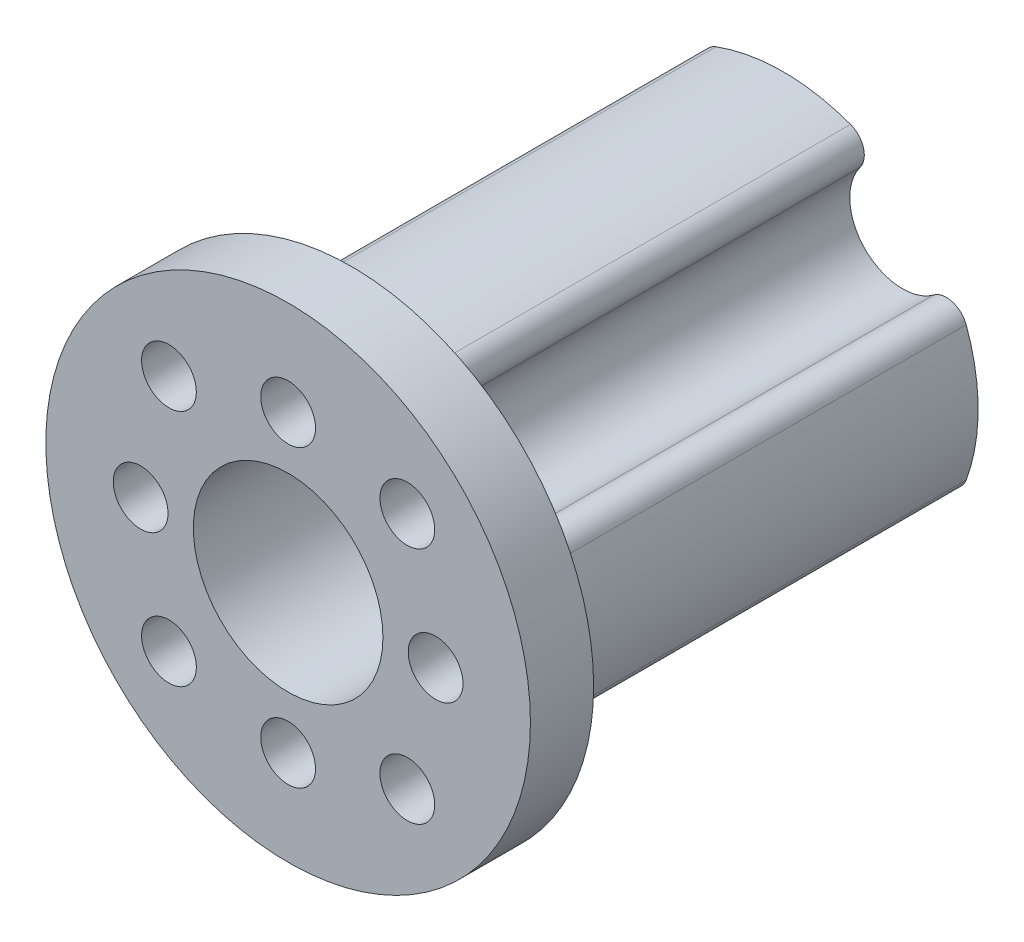
ISO-10303-21;
HEADER;
FILE_DESCRIPTION(('STEP AP214'),'2;1');
FILE_NAME('part.step','',(''),(''),'','','');
FILE_SCHEMA(('AUTOMOTIVE_DESIGN { 1 0 10303 214 1 1 1 1 }'));
ENDSEC;
DATA;
#1=APPLICATION_CONTEXT('core data for automotive mechanical design processes');
#2=APPLICATION_PROTOCOL_DEFINITION('international standard','automotive_design',2000,#1);
#3=PRODUCT_CONTEXT('',#1,'mechanical');
#4=PRODUCT('Part','Part','',(#3));
#5=PRODUCT_RELATED_PRODUCT_CATEGORY('part','',(#4));
#6=PRODUCT_DEFINITION_FORMATION('','',#4);
#7=PRODUCT_DEFINITION_CONTEXT('part definition',#1,'design');
#8=PRODUCT_DEFINITION('design','',#6,#7);
#9=PRODUCT_DEFINITION_SHAPE('','',#8);
#10=(LENGTH_UNIT() NAMED_UNIT(*) SI_UNIT(.MILLI.,.METRE.));
#11=(NAMED_UNIT(*) PLANE_ANGLE_UNIT() SI_UNIT($,.RADIAN.));
#12=(NAMED_UNIT(*) SI_UNIT($,.STERADIAN.) SOLID_ANGLE_UNIT());
#13=UNCERTAINTY_MEASURE_WITH_UNIT(LENGTH_MEASURE(1.E-05),#10,'distance_accuracy_value','');
#14=(GEOMETRIC_REPRESENTATION_CONTEXT(3) GLOBAL_UNCERTAINTY_ASSIGNED_CONTEXT((#13)) GLOBAL_UNIT_ASSIGNED_CONTEXT((#10,
#11,#12)) REPRESENTATION_CONTEXT('',''));
#15=CARTESIAN_POINT('',(0.,0.,0.));
#16=DIRECTION('',(0.,0.,1.));
#17=DIRECTION('',(1.,0.,0.));
#18=AXIS2_PLACEMENT_3D('',#15,#16,#17);
#19=CARTESIAN_POINT('',(-5.65685424949241,-5.65685424949235,0.));
#20=DIRECTION('',(0.,0.,1.));
#21=DIRECTION('',(1.,0.,0.));
#22=AXIS2_PLACEMENT_3D('',#19,#20,#21);
#23=CYLINDRICAL_SURFACE('',#22,2.5);
#24=CARTESIAN_POINT('',(-5.65685424949241,-5.65685424949235,0.));
#25=DIRECTION('',(0.,0.,1.));
#26=DIRECTION('',(1.,0.,0.));
#27=AXIS2_PLACEMENT_3D('',#24,#25,#26);
#28=CIRCLE('',#27,2.5);
#29=CARTESIAN_POINT('',(-3.64962625954334,-7.14716824203386,0.));
#30=VERTEX_POINT('',#29);
#31=CARTESIAN_POINT('',(-7.1471682420339,-3.64962625954327,0.));
#32=VERTEX_POINT('',#31);
#33=EDGE_CURVE('E260',#30,#32,#28,.T.);
#34=ORIENTED_EDGE('',*,*,#33,.F.);
#35=DIRECTION('',(0.,0.,1.));
#36=VECTOR('',#35,1.);
#37=CARTESIAN_POINT('',(-3.64962625954334,-7.14716824203386,0.));
#38=LINE('',#37,#36);
#39=CARTESIAN_POINT('',(-3.64962625954334,-7.14716824203386,20.5));
#40=VERTEX_POINT('',#39);
#41=EDGE_CURVE('E203',#30,#40,#38,.T.);
#42=ORIENTED_EDGE('',*,*,#41,.T.);
#43=CARTESIAN_POINT('',(-5.65685424949241,-5.65685424949235,20.5));
#44=DIRECTION('',(0.,0.,1.));
#45=DIRECTION('',(1.,0.,0.));
#46=AXIS2_PLACEMENT_3D('',#43,#44,#45);
#47=CIRCLE('',#46,2.5);
#48=CARTESIAN_POINT('',(-7.1471682420339,-3.64962625954327,20.5));
#49=VERTEX_POINT('',#48);
#50=EDGE_CURVE('E175',#49,#40,#47,.F.);
#51=ORIENTED_EDGE('',*,*,#50,.F.);
#52=DIRECTION('',(0.,0.,1.));
#53=VECTOR('',#52,1.);
#54=CARTESIAN_POINT('',(-7.1471682420339,-3.64962625954327,0.));
#55=LINE('',#54,#53);
#56=EDGE_CURVE('E201',#49,#32,#55,.F.);
#57=ORIENTED_EDGE('',*,*,#56,.T.);
#58=EDGE_LOOP('',(#34,#42,#51,#57));
#59=FACE_BOUND('',#58,.T.);
#60=ADVANCED_FACE('F32',(#59),#23,.F.);
#61=CARTESIAN_POINT('',(5.65685424949235,-5.65685424949241,0.));
#62=DIRECTION('',(0.,0.,1.));
#63=DIRECTION('',(1.,0.,0.));
#64=AXIS2_PLACEMENT_3D('',#61,#62,#63);
#65=CYLINDRICAL_SURFACE('',#64,2.49999999999996);
#66=CARTESIAN_POINT('',(5.65685424949235,-5.65685424949241,0.));
#67=DIRECTION('',(0.,0.,1.));
#68=DIRECTION('',(1.,0.,0.));
#69=AXIS2_PLACEMENT_3D('',#66,#67,#68);
#70=CIRCLE('',#69,2.49999999999996);
#71=CARTESIAN_POINT('',(7.14716824203385,-3.64962625954338,0.));
#72=VERTEX_POINT('',#71);
#73=CARTESIAN_POINT('',(3.6496262595433,-7.14716824203389,0.));
#74=VERTEX_POINT('',#73);
#75=EDGE_CURVE('E254',#72,#74,#70,.T.);
#76=ORIENTED_EDGE('',*,*,#75,.F.);
#77=DIRECTION('',(0.,0.,1.));
#78=VECTOR('',#77,1.);
#79=CARTESIAN_POINT('',(7.14716824203385,-3.64962625954338,0.));
#80=LINE('',#79,#78);
#81=CARTESIAN_POINT('',(7.14716824203387,-3.64962625954334,20.5));
#82=VERTEX_POINT('',#81);
#83=EDGE_CURVE('E193',#72,#82,#80,.T.);
#84=ORIENTED_EDGE('',*,*,#83,.T.);
#85=CARTESIAN_POINT('',(5.65685424949235,-5.65685424949241,20.5));
#86=DIRECTION('',(0.,0.,1.));
#87=DIRECTION('',(1.,0.,0.));
#88=AXIS2_PLACEMENT_3D('',#85,#86,#87);
#89=CIRCLE('',#88,2.5);
#90=CARTESIAN_POINT('',(3.64962625954327,-7.14716824203391,20.5));
#91=VERTEX_POINT('',#90);
#92=EDGE_CURVE('E150',#82,#91,#89,.T.);
#93=ORIENTED_EDGE('',*,*,#92,.T.);
#94=DIRECTION('',(0.,0.,1.));
#95=VECTOR('',#94,1.);
#96=CARTESIAN_POINT('',(3.6496262595433,-7.14716824203389,0.));
#97=LINE('',#96,#95);
#98=EDGE_CURVE('E191',#91,#74,#97,.F.);
#99=ORIENTED_EDGE('',*,*,#98,.T.);
#100=EDGE_LOOP('',(#76,#84,#93,#99));
#101=FACE_BOUND('',#100,.T.);
#102=ADVANCED_FACE('F330',(#101),#65,.F.);
#103=CARTESIAN_POINT('',(5.65685424949241,5.65685424949235,0.));
#104=DIRECTION('',(0.,0.,1.));
#105=DIRECTION('',(1.,0.,0.));
#106=AXIS2_PLACEMENT_3D('',#103,#104,#105);
#107=CYLINDRICAL_SURFACE('',#106,2.5);
#108=CARTESIAN_POINT('',(5.65685424949241,5.65685424949235,0.));
#109=DIRECTION('',(0.,0.,1.));
#110=DIRECTION('',(1.,0.,0.));
#111=AXIS2_PLACEMENT_3D('',#108,#109,#110);
#112=CIRCLE('',#111,2.5);
#113=CARTESIAN_POINT('',(3.64962625954334,7.14716824203386,0.));
#114=VERTEX_POINT('',#113);
#115=CARTESIAN_POINT('',(7.1471682420339,3.64962625954327,0.));
#116=VERTEX_POINT('',#115);
#117=EDGE_CURVE('E249',#114,#116,#112,.T.);
#118=ORIENTED_EDGE('',*,*,#117,.F.);
#119=DIRECTION('',(0.,0.,1.));
#120=VECTOR('',#119,1.);
#121=CARTESIAN_POINT('',(3.64962625954334,7.14716824203386,0.));
#122=LINE('',#121,#120);
#123=CARTESIAN_POINT('',(3.64962625954334,7.14716824203387,20.5));
#124=VERTEX_POINT('',#123);
#125=EDGE_CURVE('E52',#114,#124,#122,.T.);
#126=ORIENTED_EDGE('',*,*,#125,.T.);
#127=CARTESIAN_POINT('',(5.65685424949241,5.65685424949235,20.5));
#128=DIRECTION('',(0.,0.,1.));
#129=DIRECTION('',(1.,0.,0.));
#130=AXIS2_PLACEMENT_3D('',#127,#128,#129);
#131=CIRCLE('',#130,2.5);
#132=CARTESIAN_POINT('',(7.1471682420339,3.64962625954327,20.5));
#133=VERTEX_POINT('',#132);
#134=EDGE_CURVE('E235',#124,#133,#131,.T.);
#135=ORIENTED_EDGE('',*,*,#134,.T.);
#136=DIRECTION('',(0.,0.,1.));
#137=VECTOR('',#136,1.);
#138=CARTESIAN_POINT('',(7.1471682420339,3.64962625954327,0.));
#139=LINE('',#138,#137);
#140=EDGE_CURVE('E221',#133,#116,#139,.F.);
#141=ORIENTED_EDGE('',*,*,#140,.T.);
#142=EDGE_LOOP('',(#118,#126,#135,#141));
#143=FACE_BOUND('',#142,.T.);
#144=ADVANCED_FACE('F251',(#143),#107,.F.);
#145=CARTESIAN_POINT('',(-5.65685424949235,5.65685424949241,0.));
#146=DIRECTION('',(0.,0.,1.));
#147=DIRECTION('',(1.,0.,0.));
#148=AXIS2_PLACEMENT_3D('',#145,#146,#147);
#149=CYLINDRICAL_SURFACE('',#148,2.5);
#150=CARTESIAN_POINT('',(-5.65685424949235,5.65685424949241,0.));
#151=DIRECTION('',(0.,0.,1.));
#152=DIRECTION('',(1.,0.,0.));
#153=AXIS2_PLACEMENT_3D('',#150,#151,#152);
#154=CIRCLE('',#153,2.5);
#155=CARTESIAN_POINT('',(-7.14716824203386,3.64962625954334,0.));
#156=VERTEX_POINT('',#155);
#157=CARTESIAN_POINT('',(-3.64962625954326,7.1471682420339,0.));
#158=VERTEX_POINT('',#157);
#159=EDGE_CURVE('E264',#156,#158,#154,.T.);
#160=ORIENTED_EDGE('',*,*,#159,.F.);
#161=DIRECTION('',(0.,0.,1.));
#162=VECTOR('',#161,1.);
#163=CARTESIAN_POINT('',(-7.14716824203386,3.64962625954334,0.));
#164=LINE('',#163,#162);
#165=CARTESIAN_POINT('',(-7.14716824203386,3.64962625954334,20.5));
#166=VERTEX_POINT('',#165);
#167=EDGE_CURVE('E213',#156,#166,#164,.T.);
#168=ORIENTED_EDGE('',*,*,#167,.T.);
#169=CARTESIAN_POINT('',(-5.65685424949235,5.65685424949241,20.5));
#170=DIRECTION('',(0.,0.,1.));
#171=DIRECTION('',(1.,0.,0.));
#172=AXIS2_PLACEMENT_3D('',#169,#170,#171);
#173=CIRCLE('',#172,2.5);
#174=CARTESIAN_POINT('',(-3.64962625954326,7.1471682420339,20.5));
#175=VERTEX_POINT('',#174);
#176=EDGE_CURVE('E243',#175,#166,#173,.F.);
#177=ORIENTED_EDGE('',*,*,#176,.F.);
#178=DIRECTION('',(0.,0.,1.));
#179=VECTOR('',#178,1.);
#180=CARTESIAN_POINT('',(-3.64962625954326,7.1471682420339,0.));
#181=LINE('',#180,#179);
#182=EDGE_CURVE('E211',#175,#158,#181,.F.);
#183=ORIENTED_EDGE('',*,*,#182,.T.);
#184=EDGE_LOOP('',(#160,#168,#177,#183));
#185=FACE_BOUND('',#184,.T.);
#186=ADVANCED_FACE('F339',(#185),#149,.F.);
#187=CARTESIAN_POINT('',(0.,0.,23.5));
#188=DIRECTION('',(0.,0.,-1.));
#189=DIRECTION('',(-1.,0.,0.));
#190=AXIS2_PLACEMENT_3D('',#187,#188,#189);
#191=CYLINDRICAL_SURFACE('',#190,9.25);
#192=CARTESIAN_POINT('',(0.,0.,0.));
#193=DIRECTION('',(0.,0.,1.));
#194=DIRECTION('',(1.,0.,0.));
#195=AXIS2_PLACEMENT_3D('',#192,#193,#194);
#196=CIRCLE('',#195,9.25);
#197=CARTESIAN_POINT('',(-3.19179385914719,-8.68187491045052,0.));
#198=VERTEX_POINT('',#197);
#199=CARTESIAN_POINT('',(3.19179385914714,-8.68187491045054,0.));
#200=VERTEX_POINT('',#199);
#201=EDGE_CURVE('E317',#198,#200,#196,.T.);
#202=ORIENTED_EDGE('',*,*,#201,.T.);
#203=DIRECTION('',(0.,0.,-1.));
#204=VECTOR('',#203,1.);
#205=CARTESIAN_POINT('',(3.19179385914714,-8.68187491045054,23.5));
#206=LINE('',#205,#204);
#207=CARTESIAN_POINT('',(3.19179385914714,-8.68187491045054,20.5));
#208=VERTEX_POINT('',#207);
#209=EDGE_CURVE('E198',#200,#208,#206,.F.);
#210=ORIENTED_EDGE('',*,*,#209,.T.);
#211=CARTESIAN_POINT('',(0.,0.,20.5));
#212=DIRECTION('',(0.,0.,1.));
#213=DIRECTION('',(1.,0.,0.));
#214=AXIS2_PLACEMENT_3D('',#211,#212,#213);
#215=CIRCLE('',#214,9.25);
#216=CARTESIAN_POINT('',(-3.19179385914719,-8.68187491045052,20.5));
#217=VERTEX_POINT('',#216);
#218=EDGE_CURVE('E165',#217,#208,#215,.T.);
#219=ORIENTED_EDGE('',*,*,#218,.F.);
#220=DIRECTION('',(0.,0.,-1.));
#221=VECTOR('',#220,1.);
#222=CARTESIAN_POINT('',(-3.19179385914719,-8.68187491045052,23.5));
#223=LINE('',#222,#221);
#224=EDGE_CURVE('E195',#217,#198,#223,.T.);
#225=ORIENTED_EDGE('',*,*,#224,.T.);
#226=EDGE_LOOP('',(#202,#210,#219,#225));
#227=FACE_BOUND('',#226,.T.);
#228=ADVANCED_FACE('F316',(#227),#191,.T.);
#229=CARTESIAN_POINT('',(-8.68187491045052,3.19179385914719,0.));
#230=VERTEX_POINT('',#229);
#231=CARTESIAN_POINT('',(-8.68187491045055,-3.19179385914711,0.));
#232=VERTEX_POINT('',#231);
#233=EDGE_CURVE('E299',#230,#232,#196,.T.);
#234=ORIENTED_EDGE('',*,*,#233,.T.);
#235=DIRECTION('',(0.,0.,-1.));
#236=VECTOR('',#235,1.);
#237=CARTESIAN_POINT('',(-8.68187491045055,-3.19179385914711,23.5));
#238=LINE('',#237,#236);
#239=CARTESIAN_POINT('',(-8.68187491045055,-3.19179385914711,20.5));
#240=VERTEX_POINT('',#239);
#241=EDGE_CURVE('E208',#232,#240,#238,.F.);
#242=ORIENTED_EDGE('',*,*,#241,.T.);
#243=CARTESIAN_POINT('',(-8.68187491045052,3.19179385914719,20.5));
#244=VERTEX_POINT('',#243);
#245=EDGE_CURVE('E244',#244,#240,#215,.T.);
#246=ORIENTED_EDGE('',*,*,#245,.F.);
#247=DIRECTION('',(0.,0.,-1.));
#248=VECTOR('',#247,1.);
#249=CARTESIAN_POINT('',(-8.68187491045052,3.19179385914719,23.5));
#250=LINE('',#249,#248);
#251=EDGE_CURVE('E205',#244,#230,#250,.T.);
#252=ORIENTED_EDGE('',*,*,#251,.T.);
#253=EDGE_LOOP('',(#234,#242,#246,#252));
#254=FACE_BOUND('',#253,.T.);
#255=ADVANCED_FACE('F515',(#254),#191,.T.);
#256=CARTESIAN_POINT('',(3.19179385914719,8.68187491045052,0.));
#257=VERTEX_POINT('',#256);
#258=CARTESIAN_POINT('',(-3.1917938591471,8.68187491045056,0.));
#259=VERTEX_POINT('',#258);
#260=EDGE_CURVE('E166',#257,#259,#196,.T.);
#261=ORIENTED_EDGE('',*,*,#260,.T.);
#262=DIRECTION('',(0.,0.,-1.));
#263=VECTOR('',#262,1.);
#264=CARTESIAN_POINT('',(-3.1917938591471,8.68187491045056,23.5));
#265=LINE('',#264,#263);
#266=CARTESIAN_POINT('',(-3.1917938591471,8.68187491045056,20.5));
#267=VERTEX_POINT('',#266);
#268=EDGE_CURVE('E218',#259,#267,#265,.F.);
#269=ORIENTED_EDGE('',*,*,#268,.T.);
#270=CARTESIAN_POINT('',(3.19179385914719,8.68187491045052,20.5));
#271=VERTEX_POINT('',#270);
#272=EDGE_CURVE('E168',#271,#267,#215,.T.);
#273=ORIENTED_EDGE('',*,*,#272,.F.);
#274=DIRECTION('',(0.,0.,-1.));
#275=VECTOR('',#274,1.);
#276=CARTESIAN_POINT('',(3.19179385914719,8.68187491045052,23.5));
#277=LINE('',#276,#275);
#278=EDGE_CURVE('E215',#271,#257,#277,.T.);
#279=ORIENTED_EDGE('',*,*,#278,.T.);
#280=EDGE_LOOP('',(#261,#269,#273,#279));
#281=FACE_BOUND('',#280,.T.);
#282=ADVANCED_FACE('F240',(#281),#191,.T.);
#283=CARTESIAN_POINT('',(8.68187491045051,-3.19179385914724,20.5));
#284=VERTEX_POINT('',#283);
#285=CARTESIAN_POINT('',(8.68187491045055,3.19179385914711,20.5));
#286=VERTEX_POINT('',#285);
#287=EDGE_CURVE('E148',#284,#286,#215,.T.);
#288=ORIENTED_EDGE('',*,*,#287,.F.);
#289=DIRECTION('',(0.,0.,-1.));
#290=VECTOR('',#289,1.);
#291=CARTESIAN_POINT('',(8.68187491045051,-3.19179385914724,23.5));
#292=LINE('',#291,#290);
#293=CARTESIAN_POINT('',(8.68187491045051,-3.19179385914724,0.));
#294=VERTEX_POINT('',#293);
#295=EDGE_CURVE('E161',#284,#294,#292,.T.);
#296=ORIENTED_EDGE('',*,*,#295,.T.);
#297=CARTESIAN_POINT('',(8.68187491045055,3.19179385914711,0.));
#298=VERTEX_POINT('',#297);
#299=EDGE_CURVE('E298',#294,#298,#196,.T.);
#300=ORIENTED_EDGE('',*,*,#299,.T.);
#301=DIRECTION('',(0.,0.,-1.));
#302=VECTOR('',#301,1.);
#303=CARTESIAN_POINT('',(8.68187491045055,3.19179385914711,23.5));
#304=LINE('',#303,#302);
#305=EDGE_CURVE('E164',#298,#286,#304,.F.);
#306=ORIENTED_EDGE('',*,*,#305,.T.);
#307=EDGE_LOOP('',(#288,#296,#300,#306));
#308=FACE_BOUND('',#307,.T.);
#309=ADVANCED_FACE('F159',(#308),#191,.T.);
#310=CARTESIAN_POINT('',(0.,0.,23.5));
#311=DIRECTION('',(0.,0.,1.));
#312=DIRECTION('',(1.,0.,0.));
#313=AXIS2_PLACEMENT_3D('',#310,#311,#312);
#314=PLANE('',#313);
#315=CARTESIAN_POINT('',(0.,0.,23.5));
#316=DIRECTION('',(0.,0.,1.));
#317=DIRECTION('',(1.,0.,0.));
#318=AXIS2_PLACEMENT_3D('',#315,#316,#317);
#319=CIRCLE('',#318,4.5);
#320=CARTESIAN_POINT('',(4.5,0.,23.5));
#321=VERTEX_POINT('',#320);
#322=EDGE_CURVE('E271',#321,#321,#319,.T.);
#323=ORIENTED_EDGE('',*,*,#322,.F.);
#324=EDGE_LOOP('',(#323));
#325=FACE_BOUND('',#324,.T.);
#326=CARTESIAN_POINT('',(0.,-7.,23.5));
#327=DIRECTION('',(0.,0.,1.));
#328=DIRECTION('',(1.,0.,0.));
#329=AXIS2_PLACEMENT_3D('',#326,#327,#328);
#330=CIRCLE('',#329,1.3);
#331=CARTESIAN_POINT('',(1.3,-7.,23.5));
#332=VERTEX_POINT('',#331);
#333=EDGE_CURVE('E289',#332,#332,#330,.T.);
#334=ORIENTED_EDGE('',*,*,#333,.F.);
#335=EDGE_LOOP('',(#334));
#336=FACE_BOUND('',#335,.T.);
#337=CARTESIAN_POINT('',(-7.,0.,23.5));
#338=DIRECTION('',(0.,0.,1.));
#339=DIRECTION('',(1.,0.,0.));
#340=AXIS2_PLACEMENT_3D('',#337,#338,#339);
#341=CIRCLE('',#340,1.3);
#342=CARTESIAN_POINT('',(-5.7,0.,23.5));
#343=VERTEX_POINT('',#342);
#344=EDGE_CURVE('E286',#343,#343,#341,.T.);
#345=ORIENTED_EDGE('',*,*,#344,.F.);
#346=EDGE_LOOP('',(#345));
#347=FACE_BOUND('',#346,.T.);
#348=CARTESIAN_POINT('',(0.,7.,23.5));
#349=DIRECTION('',(0.,0.,1.));
#350=DIRECTION('',(1.,0.,0.));
#351=AXIS2_PLACEMENT_3D('',#348,#349,#350);
#352=CIRCLE('',#351,1.3);
#353=CARTESIAN_POINT('',(1.3,7.,23.5));
#354=VERTEX_POINT('',#353);
#355=EDGE_CURVE('E278',#354,#354,#352,.T.);
#356=ORIENTED_EDGE('',*,*,#355,.F.);
#357=EDGE_LOOP('',(#356));
#358=FACE_BOUND('',#357,.T.);
#359=CARTESIAN_POINT('',(7.,0.,23.5));
#360=DIRECTION('',(0.,0.,1.));
#361=DIRECTION('',(1.,0.,0.));
#362=AXIS2_PLACEMENT_3D('',#359,#360,#361);
#363=CIRCLE('',#362,1.3);
#364=CARTESIAN_POINT('',(8.3,0.,23.5));
#365=VERTEX_POINT('',#364);
#366=EDGE_CURVE('E295',#365,#365,#363,.T.);
#367=ORIENTED_EDGE('',*,*,#366,.F.);
#368=EDGE_LOOP('',(#367));
#369=FACE_BOUND('',#368,.T.);
#370=CARTESIAN_POINT('',(0.,0.,23.5));
#371=DIRECTION('',(0.,0.,1.));
#372=DIRECTION('',(1.,0.,0.));
#373=AXIS2_PLACEMENT_3D('',#370,#371,#372);
#374=CIRCLE('',#373,11.5);
#375=CARTESIAN_POINT('',(11.5,0.,23.5));
#376=VERTEX_POINT('',#375);
#377=EDGE_CURVE('E253',#376,#376,#374,.T.);
#378=ORIENTED_EDGE('',*,*,#377,.T.);
#379=EDGE_LOOP('',(#378));
#380=FACE_BOUND('',#379,.T.);
#381=CARTESIAN_POINT('',(-5.65685424949235,5.65685424949241,23.5));
#382=DIRECTION('',(0.,0.,1.));
#383=DIRECTION('',(1.,0.,0.));
#384=AXIS2_PLACEMENT_3D('',#381,#382,#383);
#385=CIRCLE('',#384,1.3);
#386=CARTESIAN_POINT('',(-4.35685424949235,5.65685424949241,23.5));
#387=VERTEX_POINT('',#386);
#388=EDGE_CURVE('E410',#387,#387,#385,.T.);
#389=ORIENTED_EDGE('',*,*,#388,.F.);
#390=EDGE_LOOP('',(#389));
#391=FACE_BOUND('',#390,.T.);
#392=CARTESIAN_POINT('',(5.65685424949241,5.65685424949235,23.5));
#393=DIRECTION('',(0.,0.,1.));
#394=DIRECTION('',(1.,0.,0.));
#395=AXIS2_PLACEMENT_3D('',#392,#393,#394);
#396=CIRCLE('',#395,1.3);
#397=CARTESIAN_POINT('',(6.95685424949241,5.65685424949235,23.5));
#398=VERTEX_POINT('',#397);
#399=EDGE_CURVE('E419',#398,#398,#396,.T.);
#400=ORIENTED_EDGE('',*,*,#399,.F.);
#401=EDGE_LOOP('',(#400));
#402=FACE_BOUND('',#401,.T.);
#403=CARTESIAN_POINT('',(5.65685424949235,-5.65685424949241,23.5));
#404=DIRECTION('',(0.,0.,1.));
#405=DIRECTION('',(1.,0.,0.));
#406=AXIS2_PLACEMENT_3D('',#403,#404,#405);
#407=CIRCLE('',#406,1.3);
#408=CARTESIAN_POINT('',(6.95685424949235,-5.65685424949241,23.5));
#409=VERTEX_POINT('',#408);
#410=EDGE_CURVE('E426',#409,#409,#407,.T.);
#411=ORIENTED_EDGE('',*,*,#410,.F.);
#412=EDGE_LOOP('',(#411));
#413=FACE_BOUND('',#412,.T.);
#414=CARTESIAN_POINT('',(-5.65685424949241,-5.65685424949235,23.5));
#415=DIRECTION('',(0.,0.,1.));
#416=DIRECTION('',(1.,0.,0.));
#417=AXIS2_PLACEMENT_3D('',#414,#415,#416);
#418=CIRCLE('',#417,1.3);
#419=CARTESIAN_POINT('',(-4.35685424949241,-5.65685424949235,23.5));
#420=VERTEX_POINT('',#419);
#421=EDGE_CURVE('E432',#420,#420,#418,.T.);
#422=ORIENTED_EDGE('',*,*,#421,.F.);
#423=EDGE_LOOP('',(#422));
#424=FACE_BOUND('',#423,.T.);
#425=ADVANCED_FACE('F372',(#325,#336,#347,#358,#369,#380,#391,#402,#413,#424),#314,.T.);
#426=CARTESIAN_POINT('',(0.,0.,0.));
#427=DIRECTION('',(0.,0.,1.));
#428=DIRECTION('',(1.,0.,0.));
#429=AXIS2_PLACEMENT_3D('',#426,#427,#428);
#430=PLANE('',#429);
#431=CARTESIAN_POINT('',(0.,0.,0.));
#432=DIRECTION('',(0.,0.,1.));
#433=DIRECTION('',(1.,0.,0.));
#434=AXIS2_PLACEMENT_3D('',#431,#432,#433);
#435=CIRCLE('',#434,4.5);
#436=CARTESIAN_POINT('',(4.5,0.,0.));
#437=VERTEX_POINT('',#436);
#438=EDGE_CURVE('E267',#437,#437,#435,.T.);
#439=ORIENTED_EDGE('',*,*,#438,.T.);
#440=EDGE_LOOP('',(#439));
#441=FACE_BOUND('',#440,.T.);
#442=CARTESIAN_POINT('',(0.,-7.,0.));
#443=DIRECTION('',(0.,0.,1.));
#444=DIRECTION('',(1.,0.,0.));
#445=AXIS2_PLACEMENT_3D('',#442,#443,#444);
#446=CIRCLE('',#445,1.3);
#447=CARTESIAN_POINT('',(1.3,-7.,0.));
#448=VERTEX_POINT('',#447);
#449=EDGE_CURVE('E275',#448,#448,#446,.T.);
#450=ORIENTED_EDGE('',*,*,#449,.T.);
#451=EDGE_LOOP('',(#450));
#452=FACE_BOUND('',#451,.T.);
#453=CARTESIAN_POINT('',(-7.,0.,0.));
#454=DIRECTION('',(0.,0.,1.));
#455=DIRECTION('',(1.,0.,0.));
#456=AXIS2_PLACEMENT_3D('',#453,#454,#455);
#457=CIRCLE('',#456,1.3);
#458=CARTESIAN_POINT('',(-5.7,0.,0.));
#459=VERTEX_POINT('',#458);
#460=EDGE_CURVE('E279',#459,#459,#457,.T.);
#461=ORIENTED_EDGE('',*,*,#460,.T.);
#462=EDGE_LOOP('',(#461));
#463=FACE_BOUND('',#462,.T.);
#464=CARTESIAN_POINT('',(0.,7.,0.));
#465=DIRECTION('',(0.,0.,1.));
#466=DIRECTION('',(1.,0.,0.));
#467=AXIS2_PLACEMENT_3D('',#464,#465,#466);
#468=CIRCLE('',#467,1.3);
#469=CARTESIAN_POINT('',(1.3,7.,0.));
#470=VERTEX_POINT('',#469);
#471=EDGE_CURVE('E274',#470,#470,#468,.T.);
#472=ORIENTED_EDGE('',*,*,#471,.T.);
#473=EDGE_LOOP('',(#472));
#474=FACE_BOUND('',#473,.T.);
#475=CARTESIAN_POINT('',(7.,0.,0.));
#476=DIRECTION('',(0.,0.,1.));
#477=DIRECTION('',(1.,0.,0.));
#478=AXIS2_PLACEMENT_3D('',#475,#476,#477);
#479=CIRCLE('',#478,1.3);
#480=CARTESIAN_POINT('',(8.3,0.,0.));
#481=VERTEX_POINT('',#480);
#482=EDGE_CURVE('E292',#481,#481,#479,.T.);
#483=ORIENTED_EDGE('',*,*,#482,.T.);
#484=EDGE_LOOP('',(#483));
#485=FACE_BOUND('',#484,.T.);
#486=ORIENTED_EDGE('',*,*,#299,.F.);
#487=CARTESIAN_POINT('',(7.74329383905045,-2.84673506356375,0.));
#488=DIRECTION('',(0.,0.,1.));
#489=DIRECTION('',(1.,0.,0.));
#490=AXIS2_PLACEMENT_3D('',#487,#488,#489);
#491=CIRCLE('',#490,1.);
#492=EDGE_CURVE('E170',#294,#72,#491,.F.);
#493=ORIENTED_EDGE('',*,*,#492,.T.);
#494=ORIENTED_EDGE('',*,*,#75,.T.);
#495=CARTESIAN_POINT('',(2.84673506356367,-7.74329383905048,0.));
#496=DIRECTION('',(0.,0.,1.));
#497=DIRECTION('',(1.,0.,0.));
#498=AXIS2_PLACEMENT_3D('',#495,#496,#497);
#499=CIRCLE('',#498,1.);
#500=EDGE_CURVE('E188',#74,#200,#499,.F.);
#501=ORIENTED_EDGE('',*,*,#500,.T.);
#502=ORIENTED_EDGE('',*,*,#201,.F.);
#503=CARTESIAN_POINT('',(-2.84673506356371,-7.74329383905047,0.));
#504=DIRECTION('',(0.,0.,1.));
#505=DIRECTION('',(1.,0.,0.));
#506=AXIS2_PLACEMENT_3D('',#503,#504,#505);
#507=CIRCLE('',#506,1.);
#508=EDGE_CURVE('E186',#198,#30,#507,.F.);
#509=ORIENTED_EDGE('',*,*,#508,.T.);
#510=ORIENTED_EDGE('',*,*,#33,.T.);
#511=CARTESIAN_POINT('',(-7.7432938390505,-2.84673506356364,0.));
#512=DIRECTION('',(0.,0.,1.));
#513=DIRECTION('',(1.,0.,0.));
#514=AXIS2_PLACEMENT_3D('',#511,#512,#513);
#515=CIRCLE('',#514,1.);
#516=EDGE_CURVE('E184',#32,#232,#515,.F.);
#517=ORIENTED_EDGE('',*,*,#516,.T.);
#518=ORIENTED_EDGE('',*,*,#233,.F.);
#519=CARTESIAN_POINT('',(-7.74329383905047,2.84673506356371,0.));
#520=DIRECTION('',(0.,0.,1.));
#521=DIRECTION('',(1.,0.,0.));
#522=AXIS2_PLACEMENT_3D('',#519,#520,#521);
#523=CIRCLE('',#522,1.);
#524=EDGE_CURVE('E182',#230,#156,#523,.F.);
#525=ORIENTED_EDGE('',*,*,#524,.T.);
#526=ORIENTED_EDGE('',*,*,#159,.T.);
#527=CARTESIAN_POINT('',(-2.84673506356363,7.7432938390505,0.));
#528=DIRECTION('',(0.,0.,1.));
#529=DIRECTION('',(1.,0.,0.));
#530=AXIS2_PLACEMENT_3D('',#527,#528,#529);
#531=CIRCLE('',#530,1.);
#532=EDGE_CURVE('E180',#158,#259,#531,.F.);
#533=ORIENTED_EDGE('',*,*,#532,.T.);
#534=ORIENTED_EDGE('',*,*,#260,.F.);
#535=CARTESIAN_POINT('',(2.84673506356371,7.74329383905047,0.));
#536=DIRECTION('',(0.,0.,1.));
#537=DIRECTION('',(1.,0.,0.));
#538=AXIS2_PLACEMENT_3D('',#535,#536,#537);
#539=CIRCLE('',#538,1.);
#540=EDGE_CURVE('E173',#257,#114,#539,.F.);
#541=ORIENTED_EDGE('',*,*,#540,.T.);
#542=ORIENTED_EDGE('',*,*,#117,.T.);
#543=CARTESIAN_POINT('',(7.7432938390505,2.84673506356364,0.));
#544=DIRECTION('',(0.,0.,1.));
#545=DIRECTION('',(1.,0.,0.));
#546=AXIS2_PLACEMENT_3D('',#543,#544,#545);
#547=CIRCLE('',#546,1.);
#548=EDGE_CURVE('E171',#116,#298,#547,.F.);
#549=ORIENTED_EDGE('',*,*,#548,.T.);
#550=EDGE_LOOP('',(#486,#493,#494,#501,#502,#509,#510,#517,#518,#525,#526,#533,#534,#541,#542,#549));
#551=FACE_BOUND('',#550,.T.);
#552=ADVANCED_FACE('F248',(#441,#452,#463,#474,#485,#551),#430,.F.);
#553=CARTESIAN_POINT('',(7.,0.,0.));
#554=DIRECTION('',(0.,0.,1.));
#555=DIRECTION('',(1.,0.,0.));
#556=AXIS2_PLACEMENT_3D('',#553,#554,#555);
#557=CYLINDRICAL_SURFACE('',#556,1.3);
#558=ORIENTED_EDGE('',*,*,#366,.T.);
#559=EDGE_LOOP('',(#558));
#560=FACE_BOUND('',#559,.T.);
#561=ORIENTED_EDGE('',*,*,#482,.F.);
#562=EDGE_LOOP('',(#561));
#563=FACE_BOUND('',#562,.T.);
#564=ADVANCED_FACE('F367',(#560,#563),#557,.F.);
#565=CARTESIAN_POINT('',(0.,7.,0.));
#566=DIRECTION('',(0.,0.,1.));
#567=DIRECTION('',(1.,0.,0.));
#568=AXIS2_PLACEMENT_3D('',#565,#566,#567);
#569=CYLINDRICAL_SURFACE('',#568,1.3);
#570=ORIENTED_EDGE('',*,*,#355,.T.);
#571=EDGE_LOOP('',(#570));
#572=FACE_BOUND('',#571,.T.);
#573=ORIENTED_EDGE('',*,*,#471,.F.);
#574=EDGE_LOOP('',(#573));
#575=FACE_BOUND('',#574,.T.);
#576=ADVANCED_FACE('F363',(#572,#575),#569,.F.);
#577=CARTESIAN_POINT('',(-7.,0.,0.));
#578=DIRECTION('',(0.,0.,1.));
#579=DIRECTION('',(1.,0.,0.));
#580=AXIS2_PLACEMENT_3D('',#577,#578,#579);
#581=CYLINDRICAL_SURFACE('',#580,1.3);
#582=ORIENTED_EDGE('',*,*,#344,.T.);
#583=EDGE_LOOP('',(#582));
#584=FACE_BOUND('',#583,.T.);
#585=ORIENTED_EDGE('',*,*,#460,.F.);
#586=EDGE_LOOP('',(#585));
#587=FACE_BOUND('',#586,.T.);
#588=ADVANCED_FACE('F359',(#584,#587),#581,.F.);
#589=CARTESIAN_POINT('',(0.,-7.,0.));
#590=DIRECTION('',(0.,0.,1.));
#591=DIRECTION('',(1.,0.,0.));
#592=AXIS2_PLACEMENT_3D('',#589,#590,#591);
#593=CYLINDRICAL_SURFACE('',#592,1.3);
#594=ORIENTED_EDGE('',*,*,#333,.T.);
#595=EDGE_LOOP('',(#594));
#596=FACE_BOUND('',#595,.T.);
#597=ORIENTED_EDGE('',*,*,#449,.F.);
#598=EDGE_LOOP('',(#597));
#599=FACE_BOUND('',#598,.T.);
#600=ADVANCED_FACE('F355',(#596,#599),#593,.F.);
#601=CARTESIAN_POINT('',(0.,0.,0.));
#602=DIRECTION('',(0.,0.,1.));
#603=DIRECTION('',(1.,0.,0.));
#604=AXIS2_PLACEMENT_3D('',#601,#602,#603);
#605=CYLINDRICAL_SURFACE('',#604,4.5);
#606=ORIENTED_EDGE('',*,*,#322,.T.);
#607=EDGE_LOOP('',(#606));
#608=FACE_BOUND('',#607,.T.);
#609=ORIENTED_EDGE('',*,*,#438,.F.);
#610=EDGE_LOOP('',(#609));
#611=FACE_BOUND('',#610,.T.);
#612=ADVANCED_FACE('F351',(#608,#611),#605,.F.);
#613=CARTESIAN_POINT('',(0.,0.,20.5));
#614=DIRECTION('',(0.,0.,1.));
#615=DIRECTION('',(1.,0.,0.));
#616=AXIS2_PLACEMENT_3D('',#613,#614,#615);
#617=CYLINDRICAL_SURFACE('',#616,11.5);
#618=CARTESIAN_POINT('',(0.,0.,20.5));
#619=DIRECTION('',(0.,0.,1.));
#620=DIRECTION('',(1.,0.,0.));
#621=AXIS2_PLACEMENT_3D('',#618,#619,#620);
#622=CIRCLE('',#621,11.5);
#623=CARTESIAN_POINT('',(11.5,0.,20.5));
#624=VERTEX_POINT('',#623);
#625=EDGE_CURVE('E257',#624,#624,#622,.T.);
#626=ORIENTED_EDGE('',*,*,#625,.T.);
#627=EDGE_LOOP('',(#626));
#628=FACE_BOUND('',#627,.T.);
#629=ORIENTED_EDGE('',*,*,#377,.F.);
#630=EDGE_LOOP('',(#629));
#631=FACE_BOUND('',#630,.T.);
#632=ADVANCED_FACE('F348',(#628,#631),#617,.T.);
#633=CARTESIAN_POINT('',(0.,0.,20.5));
#634=DIRECTION('',(0.,0.,1.));
#635=DIRECTION('',(1.,0.,0.));
#636=AXIS2_PLACEMENT_3D('',#633,#634,#635);
#637=PLANE('',#636);
#638=ORIENTED_EDGE('',*,*,#50,.T.);
#639=CARTESIAN_POINT('',(-2.84673506356371,-7.74329383905047,20.5));
#640=DIRECTION('',(0.,0.,1.));
#641=DIRECTION('',(1.,0.,0.));
#642=AXIS2_PLACEMENT_3D('',#639,#640,#641);
#643=CIRCLE('',#642,1.);
#644=EDGE_CURVE('E225',#40,#217,#643,.T.);
#645=ORIENTED_EDGE('',*,*,#644,.T.);
#646=ORIENTED_EDGE('',*,*,#218,.T.);
#647=CARTESIAN_POINT('',(2.84673506356367,-7.74329383905048,20.5));
#648=DIRECTION('',(0.,0.,1.));
#649=DIRECTION('',(1.,0.,0.));
#650=AXIS2_PLACEMENT_3D('',#647,#648,#649);
#651=CIRCLE('',#650,1.);
#652=EDGE_CURVE('E154',#208,#91,#651,.T.);
#653=ORIENTED_EDGE('',*,*,#652,.T.);
#654=ORIENTED_EDGE('',*,*,#92,.F.);
#655=CARTESIAN_POINT('',(7.74329383905045,-2.84673506356375,20.5));
#656=DIRECTION('',(0.,0.,1.));
#657=DIRECTION('',(1.,0.,0.));
#658=AXIS2_PLACEMENT_3D('',#655,#656,#657);
#659=CIRCLE('',#658,1.);
#660=EDGE_CURVE('E143',#82,#284,#659,.T.);
#661=ORIENTED_EDGE('',*,*,#660,.T.);
#662=ORIENTED_EDGE('',*,*,#287,.T.);
#663=CARTESIAN_POINT('',(7.7432938390505,2.84673506356364,20.5));
#664=DIRECTION('',(0.,0.,1.));
#665=DIRECTION('',(1.,0.,0.));
#666=AXIS2_PLACEMENT_3D('',#663,#664,#665);
#667=CIRCLE('',#666,1.);
#668=EDGE_CURVE('E11',#286,#133,#667,.T.);
#669=ORIENTED_EDGE('',*,*,#668,.T.);
#670=ORIENTED_EDGE('',*,*,#134,.F.);
#671=CARTESIAN_POINT('',(2.84673506356371,7.74329383905047,20.5));
#672=DIRECTION('',(0.,0.,1.));
#673=DIRECTION('',(1.,0.,0.));
#674=AXIS2_PLACEMENT_3D('',#671,#672,#673);
#675=CIRCLE('',#674,1.);
#676=EDGE_CURVE('E40',#124,#271,#675,.T.);
#677=ORIENTED_EDGE('',*,*,#676,.T.);
#678=ORIENTED_EDGE('',*,*,#272,.T.);
#679=CARTESIAN_POINT('',(-2.84673506356363,7.7432938390505,20.5));
#680=DIRECTION('',(0.,0.,1.));
#681=DIRECTION('',(1.,0.,0.));
#682=AXIS2_PLACEMENT_3D('',#679,#680,#681);
#683=CIRCLE('',#682,1.);
#684=EDGE_CURVE('E231',#267,#175,#683,.T.);
#685=ORIENTED_EDGE('',*,*,#684,.T.);
#686=ORIENTED_EDGE('',*,*,#176,.T.);
#687=CARTESIAN_POINT('',(-7.74329383905047,2.84673506356371,20.5));
#688=DIRECTION('',(0.,0.,1.));
#689=DIRECTION('',(1.,0.,0.));
#690=AXIS2_PLACEMENT_3D('',#687,#688,#689);
#691=CIRCLE('',#690,1.);
#692=EDGE_CURVE('E229',#166,#244,#691,.T.);
#693=ORIENTED_EDGE('',*,*,#692,.T.);
#694=ORIENTED_EDGE('',*,*,#245,.T.);
#695=CARTESIAN_POINT('',(-7.7432938390505,-2.84673506356364,20.5));
#696=DIRECTION('',(0.,0.,1.));
#697=DIRECTION('',(1.,0.,0.));
#698=AXIS2_PLACEMENT_3D('',#695,#696,#697);
#699=CIRCLE('',#698,1.);
#700=EDGE_CURVE('E227',#240,#49,#699,.T.);
#701=ORIENTED_EDGE('',*,*,#700,.T.);
#702=EDGE_LOOP('',(#638,#645,#646,#653,#654,#661,#662,#669,#670,#677,#678,#685,#686,#693,#694,#701));
#703=FACE_BOUND('',#702,.T.);
#704=ORIENTED_EDGE('',*,*,#625,.F.);
#705=EDGE_LOOP('',(#704));
#706=FACE_BOUND('',#705,.T.);
#707=CARTESIAN_POINT('',(-5.65685424949235,5.65685424949241,20.5));
#708=DIRECTION('',(0.,0.,1.));
#709=DIRECTION('',(1.,0.,0.));
#710=AXIS2_PLACEMENT_3D('',#707,#708,#709);
#711=CIRCLE('',#710,1.3);
#712=CARTESIAN_POINT('',(-4.35685424949235,5.65685424949241,20.5));
#713=VERTEX_POINT('',#712);
#714=EDGE_CURVE('E408',#713,#713,#711,.T.);
#715=ORIENTED_EDGE('',*,*,#714,.T.);
#716=EDGE_LOOP('',(#715));
#717=FACE_BOUND('',#716,.T.);
#718=CARTESIAN_POINT('',(5.65685424949241,5.65685424949235,20.5));
#719=DIRECTION('',(0.,0.,1.));
#720=DIRECTION('',(1.,0.,0.));
#721=AXIS2_PLACEMENT_3D('',#718,#719,#720);
#722=CIRCLE('',#721,1.3);
#723=CARTESIAN_POINT('',(6.95685424949241,5.65685424949235,20.5));
#724=VERTEX_POINT('',#723);
#725=EDGE_CURVE('E418',#724,#724,#722,.T.);
#726=ORIENTED_EDGE('',*,*,#725,.T.);
#727=EDGE_LOOP('',(#726));
#728=FACE_BOUND('',#727,.T.);
#729=CARTESIAN_POINT('',(5.65685424949235,-5.65685424949241,20.5));
#730=DIRECTION('',(0.,0.,1.));
#731=DIRECTION('',(1.,0.,0.));
#732=AXIS2_PLACEMENT_3D('',#729,#730,#731);
#733=CIRCLE('',#732,1.3);
#734=CARTESIAN_POINT('',(6.95685424949235,-5.65685424949241,20.5));
#735=VERTEX_POINT('',#734);
#736=EDGE_CURVE('E425',#735,#735,#733,.T.);
#737=ORIENTED_EDGE('',*,*,#736,.T.);
#738=EDGE_LOOP('',(#737));
#739=FACE_BOUND('',#738,.T.);
#740=CARTESIAN_POINT('',(-5.65685424949241,-5.65685424949235,20.5));
#741=DIRECTION('',(0.,0.,1.));
#742=DIRECTION('',(1.,0.,0.));
#743=AXIS2_PLACEMENT_3D('',#740,#741,#742);
#744=CIRCLE('',#743,1.3);
#745=CARTESIAN_POINT('',(-4.35685424949241,-5.65685424949235,20.5));
#746=VERTEX_POINT('',#745);
#747=EDGE_CURVE('E429',#746,#746,#744,.T.);
#748=ORIENTED_EDGE('',*,*,#747,.T.);
#749=EDGE_LOOP('',(#748));
#750=FACE_BOUND('',#749,.T.);
#751=ADVANCED_FACE('F146',(#703,#706,#717,#728,#739,#750),#637,.F.);
#752=CARTESIAN_POINT('',(-5.65685424949235,5.65685424949241,20.5));
#753=DIRECTION('',(0.,0.,1.));
#754=DIRECTION('',(1.,0.,0.));
#755=AXIS2_PLACEMENT_3D('',#752,#753,#754);
#756=CYLINDRICAL_SURFACE('',#755,1.3);
#757=ORIENTED_EDGE('',*,*,#714,.F.);
#758=EDGE_LOOP('',(#757));
#759=FACE_BOUND('',#758,.T.);
#760=ORIENTED_EDGE('',*,*,#388,.T.);
#761=EDGE_LOOP('',(#760));
#762=FACE_BOUND('',#761,.T.);
#763=ADVANCED_FACE('F347',(#759,#762),#756,.F.);
#764=CARTESIAN_POINT('',(5.65685424949241,5.65685424949235,20.5));
#765=DIRECTION('',(0.,0.,1.));
#766=DIRECTION('',(1.,0.,0.));
#767=AXIS2_PLACEMENT_3D('',#764,#765,#766);
#768=CYLINDRICAL_SURFACE('',#767,1.3);
#769=ORIENTED_EDGE('',*,*,#725,.F.);
#770=EDGE_LOOP('',(#769));
#771=FACE_BOUND('',#770,.T.);
#772=ORIENTED_EDGE('',*,*,#399,.T.);
#773=EDGE_LOOP('',(#772));
#774=FACE_BOUND('',#773,.T.);
#775=ADVANCED_FACE('F448',(#771,#774),#768,.F.);
#776=CARTESIAN_POINT('',(5.65685424949235,-5.65685424949241,20.5));
#777=DIRECTION('',(0.,0.,1.));
#778=DIRECTION('',(1.,0.,0.));
#779=AXIS2_PLACEMENT_3D('',#776,#777,#778);
#780=CYLINDRICAL_SURFACE('',#779,1.3);
#781=ORIENTED_EDGE('',*,*,#736,.F.);
#782=EDGE_LOOP('',(#781));
#783=FACE_BOUND('',#782,.T.);
#784=ORIENTED_EDGE('',*,*,#410,.T.);
#785=EDGE_LOOP('',(#784));
#786=FACE_BOUND('',#785,.T.);
#787=ADVANCED_FACE('F441',(#783,#786),#780,.F.);
#788=CARTESIAN_POINT('',(-5.65685424949241,-5.65685424949235,20.5));
#789=DIRECTION('',(0.,0.,1.));
#790=DIRECTION('',(1.,0.,0.));
#791=AXIS2_PLACEMENT_3D('',#788,#789,#790);
#792=CYLINDRICAL_SURFACE('',#791,1.3);
#793=ORIENTED_EDGE('',*,*,#747,.F.);
#794=EDGE_LOOP('',(#793));
#795=FACE_BOUND('',#794,.T.);
#796=ORIENTED_EDGE('',*,*,#421,.T.);
#797=EDGE_LOOP('',(#796));
#798=FACE_BOUND('',#797,.T.);
#799=ADVANCED_FACE('F384',(#795,#798),#792,.F.);
#800=CARTESIAN_POINT('',(7.74329383905045,-2.84673506356375,0.));
#801=DIRECTION('',(0.,0.,1.));
#802=DIRECTION('',(1.,0.,0.));
#803=AXIS2_PLACEMENT_3D('',#800,#801,#802);
#804=CYLINDRICAL_SURFACE('',#803,1.);
#805=ORIENTED_EDGE('',*,*,#660,.F.);
#806=ORIENTED_EDGE('',*,*,#83,.F.);
#807=ORIENTED_EDGE('',*,*,#492,.F.);
#808=ORIENTED_EDGE('',*,*,#295,.F.);
#809=EDGE_LOOP('',(#805,#806,#807,#808));
#810=FACE_BOUND('',#809,.T.);
#811=ADVANCED_FACE('F169',(#810),#804,.T.);
#812=CARTESIAN_POINT('',(2.84673506356367,-7.74329383905048,0.));
#813=DIRECTION('',(0.,0.,-1.));
#814=DIRECTION('',(-1.,0.,0.));
#815=AXIS2_PLACEMENT_3D('',#812,#813,#814);
#816=CYLINDRICAL_SURFACE('',#815,1.);
#817=ORIENTED_EDGE('',*,*,#500,.F.);
#818=ORIENTED_EDGE('',*,*,#98,.F.);
#819=ORIENTED_EDGE('',*,*,#652,.F.);
#820=ORIENTED_EDGE('',*,*,#209,.F.);
#821=EDGE_LOOP('',(#817,#818,#819,#820));
#822=FACE_BOUND('',#821,.T.);
#823=ADVANCED_FACE('F383',(#822),#816,.T.);
#824=CARTESIAN_POINT('',(-2.84673506356371,-7.74329383905047,0.));
#825=DIRECTION('',(0.,0.,1.));
#826=DIRECTION('',(1.,0.,0.));
#827=AXIS2_PLACEMENT_3D('',#824,#825,#826);
#828=CYLINDRICAL_SURFACE('',#827,1.);
#829=ORIENTED_EDGE('',*,*,#644,.F.);
#830=ORIENTED_EDGE('',*,*,#41,.F.);
#831=ORIENTED_EDGE('',*,*,#508,.F.);
#832=ORIENTED_EDGE('',*,*,#224,.F.);
#833=EDGE_LOOP('',(#829,#830,#831,#832));
#834=FACE_BOUND('',#833,.T.);
#835=ADVANCED_FACE('F312',(#834),#828,.T.);
#836=CARTESIAN_POINT('',(-7.7432938390505,-2.84673506356364,0.));
#837=DIRECTION('',(0.,0.,-1.));
#838=DIRECTION('',(-1.,0.,0.));
#839=AXIS2_PLACEMENT_3D('',#836,#837,#838);
#840=CYLINDRICAL_SURFACE('',#839,1.);
#841=ORIENTED_EDGE('',*,*,#516,.F.);
#842=ORIENTED_EDGE('',*,*,#56,.F.);
#843=ORIENTED_EDGE('',*,*,#700,.F.);
#844=ORIENTED_EDGE('',*,*,#241,.F.);
#845=EDGE_LOOP('',(#841,#842,#843,#844));
#846=FACE_BOUND('',#845,.T.);
#847=ADVANCED_FACE('F390',(#846),#840,.T.);
#848=CARTESIAN_POINT('',(-7.74329383905047,2.84673506356371,0.));
#849=DIRECTION('',(0.,0.,1.));
#850=DIRECTION('',(1.,0.,0.));
#851=AXIS2_PLACEMENT_3D('',#848,#849,#850);
#852=CYLINDRICAL_SURFACE('',#851,1.);
#853=ORIENTED_EDGE('',*,*,#692,.F.);
#854=ORIENTED_EDGE('',*,*,#167,.F.);
#855=ORIENTED_EDGE('',*,*,#524,.F.);
#856=ORIENTED_EDGE('',*,*,#251,.F.);
#857=EDGE_LOOP('',(#853,#854,#855,#856));
#858=FACE_BOUND('',#857,.T.);
#859=ADVANCED_FACE('F393',(#858),#852,.T.);
#860=CARTESIAN_POINT('',(-2.84673506356363,7.7432938390505,0.));
#861=DIRECTION('',(0.,0.,-1.));
#862=DIRECTION('',(-1.,0.,0.));
#863=AXIS2_PLACEMENT_3D('',#860,#861,#862);
#864=CYLINDRICAL_SURFACE('',#863,1.);
#865=ORIENTED_EDGE('',*,*,#532,.F.);
#866=ORIENTED_EDGE('',*,*,#182,.F.);
#867=ORIENTED_EDGE('',*,*,#684,.F.);
#868=ORIENTED_EDGE('',*,*,#268,.F.);
#869=EDGE_LOOP('',(#865,#866,#867,#868));
#870=FACE_BOUND('',#869,.T.);
#871=ADVANCED_FACE('F328',(#870),#864,.T.);
#872=CARTESIAN_POINT('',(2.84673506356371,7.74329383905047,0.));
#873=DIRECTION('',(0.,0.,1.));
#874=DIRECTION('',(1.,0.,0.));
#875=AXIS2_PLACEMENT_3D('',#872,#873,#874);
#876=CYLINDRICAL_SURFACE('',#875,1.);
#877=ORIENTED_EDGE('',*,*,#676,.F.);
#878=ORIENTED_EDGE('',*,*,#125,.F.);
#879=ORIENTED_EDGE('',*,*,#540,.F.);
#880=ORIENTED_EDGE('',*,*,#278,.F.);
#881=EDGE_LOOP('',(#877,#878,#879,#880));
#882=FACE_BOUND('',#881,.T.);
#883=ADVANCED_FACE('F245',(#882),#876,.T.);
#884=CARTESIAN_POINT('',(7.7432938390505,2.84673506356364,0.));
#885=DIRECTION('',(0.,0.,-1.));
#886=DIRECTION('',(-1.,0.,0.));
#887=AXIS2_PLACEMENT_3D('',#884,#885,#886);
#888=CYLINDRICAL_SURFACE('',#887,1.);
#889=ORIENTED_EDGE('',*,*,#548,.F.);
#890=ORIENTED_EDGE('',*,*,#140,.F.);
#891=ORIENTED_EDGE('',*,*,#668,.F.);
#892=ORIENTED_EDGE('',*,*,#305,.F.);
#893=EDGE_LOOP('',(#889,#890,#891,#892));
#894=FACE_BOUND('',#893,.T.);
#895=ADVANCED_FACE('F34',(#894),#888,.T.);
#896=CLOSED_SHELL('',(#60,#102,#144,#186,#228,#255,#282,#309,#425,#552,#564,#576,#588,#600,#612,
#632,#751,#763,#775,#787,#799,#811,#823,#835,#847,#859,#871,#883,#895));
#897=MANIFOLD_SOLID_BREP('B2',#896);
#898=ADVANCED_BREP_SHAPE_REPRESENTATION('',(#18,#897),#14);
#899=SHAPE_DEFINITION_REPRESENTATION(#9,#898);
ENDSEC;
END-ISO-10303-21;
